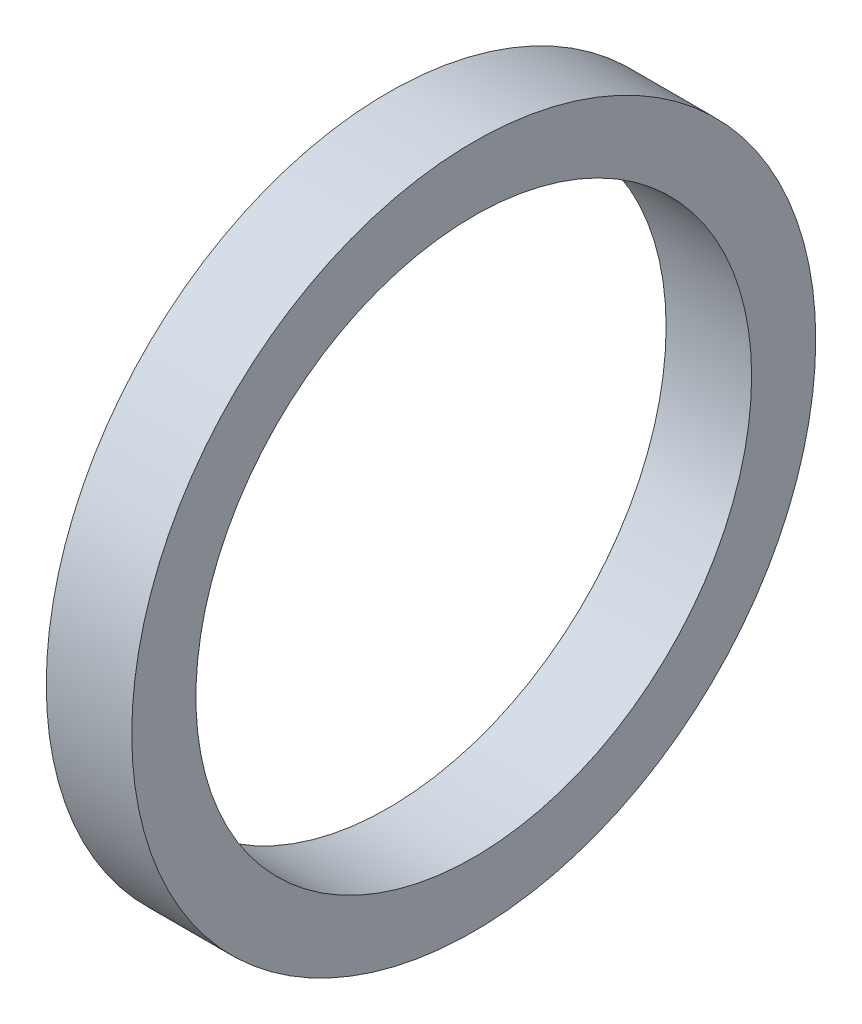
ISO-10303-21;
HEADER;
FILE_DESCRIPTION(('STEP AP214'),'2;1');
FILE_NAME('part.step','',(''),(''),'','','');
FILE_SCHEMA(('AUTOMOTIVE_DESIGN { 1 0 10303 214 1 1 1 1 }'));
ENDSEC;
DATA;
#1=APPLICATION_CONTEXT('core data for automotive mechanical design processes');
#2=APPLICATION_PROTOCOL_DEFINITION('international standard','automotive_design',2000,#1);
#3=PRODUCT_CONTEXT('',#1,'mechanical');
#4=PRODUCT('Part','Part','',(#3));
#5=PRODUCT_RELATED_PRODUCT_CATEGORY('part','',(#4));
#6=PRODUCT_DEFINITION_FORMATION('','',#4);
#7=PRODUCT_DEFINITION_CONTEXT('part definition',#1,'design');
#8=PRODUCT_DEFINITION('design','',#6,#7);
#9=PRODUCT_DEFINITION_SHAPE('','',#8);
#10=(LENGTH_UNIT() NAMED_UNIT(*) SI_UNIT(.MILLI.,.METRE.));
#11=(NAMED_UNIT(*) PLANE_ANGLE_UNIT() SI_UNIT($,.RADIAN.));
#12=(NAMED_UNIT(*) SI_UNIT($,.STERADIAN.) SOLID_ANGLE_UNIT());
#13=UNCERTAINTY_MEASURE_WITH_UNIT(LENGTH_MEASURE(1.E-05),#10,'distance_accuracy_value','');
#14=(GEOMETRIC_REPRESENTATION_CONTEXT(3) GLOBAL_UNCERTAINTY_ASSIGNED_CONTEXT((#13)) GLOBAL_UNIT_ASSIGNED_CONTEXT((#10,
#11,#12)) REPRESENTATION_CONTEXT('',''));
#15=CARTESIAN_POINT('',(0.,0.,0.));
#16=DIRECTION('',(0.,0.,1.));
#17=DIRECTION('',(1.,0.,0.));
#18=AXIS2_PLACEMENT_3D('',#15,#16,#17);
#19=CARTESIAN_POINT('',(10.,0.,0.));
#20=DIRECTION('',(1.,0.,0.));
#21=DIRECTION('',(0.,0.,-1.));
#22=AXIS2_PLACEMENT_3D('',#19,#20,#21);
#23=PLANE('',#22);
#24=CARTESIAN_POINT('',(10.,0.,0.));
#25=DIRECTION('',(1.,0.,0.));
#26=DIRECTION('',(0.,0.,-1.));
#27=AXIS2_PLACEMENT_3D('',#24,#25,#26);
#28=CIRCLE('',#27,40.);
#29=CARTESIAN_POINT('',(10.,0.,-40.));
#30=VERTEX_POINT('',#29);
#31=EDGE_CURVE('E10',#30,#30,#28,.T.);
#32=ORIENTED_EDGE('',*,*,#31,.T.);
#33=EDGE_LOOP('',(#32));
#34=FACE_BOUND('',#33,.T.);
#35=CARTESIAN_POINT('',(10.,0.,0.));
#36=DIRECTION('',(1.,0.,0.));
#37=DIRECTION('',(0.,0.,-1.));
#38=AXIS2_PLACEMENT_3D('',#35,#36,#37);
#39=CIRCLE('',#38,32.5);
#40=CARTESIAN_POINT('',(10.,0.,-32.5));
#41=VERTEX_POINT('',#40);
#42=EDGE_CURVE('E42',#41,#41,#39,.T.);
#43=ORIENTED_EDGE('',*,*,#42,.F.);
#44=EDGE_LOOP('',(#43));
#45=FACE_BOUND('',#44,.T.);
#46=ADVANCED_FACE('F31',(#34,#45),#23,.T.);
#47=CARTESIAN_POINT('',(0.,0.,0.));
#48=DIRECTION('',(1.,0.,0.));
#49=DIRECTION('',(0.,0.,-1.));
#50=AXIS2_PLACEMENT_3D('',#47,#48,#49);
#51=PLANE('',#50);
#52=CARTESIAN_POINT('',(0.,0.,0.));
#53=DIRECTION('',(1.,0.,0.));
#54=DIRECTION('',(0.,0.,-1.));
#55=AXIS2_PLACEMENT_3D('',#52,#53,#54);
#56=CIRCLE('',#55,40.);
#57=CARTESIAN_POINT('',(0.,0.,-40.));
#58=VERTEX_POINT('',#57);
#59=EDGE_CURVE('E35',#58,#58,#56,.T.);
#60=ORIENTED_EDGE('',*,*,#59,.F.);
#61=EDGE_LOOP('',(#60));
#62=FACE_BOUND('',#61,.T.);
#63=CARTESIAN_POINT('',(0.,0.,0.));
#64=DIRECTION('',(1.,0.,0.));
#65=DIRECTION('',(0.,0.,-1.));
#66=AXIS2_PLACEMENT_3D('',#63,#64,#65);
#67=CIRCLE('',#66,32.5);
#68=CARTESIAN_POINT('',(0.,0.,-32.5));
#69=VERTEX_POINT('',#68);
#70=EDGE_CURVE('E44',#69,#69,#67,.T.);
#71=ORIENTED_EDGE('',*,*,#70,.T.);
#72=EDGE_LOOP('',(#71));
#73=FACE_BOUND('',#72,.T.);
#74=ADVANCED_FACE('F54',(#62,#73),#51,.F.);
#75=CARTESIAN_POINT('',(10.,0.,0.));
#76=DIRECTION('',(-1.,0.,0.));
#77=DIRECTION('',(0.,0.,1.));
#78=AXIS2_PLACEMENT_3D('',#75,#76,#77);
#79=CYLINDRICAL_SURFACE('',#78,40.);
#80=ORIENTED_EDGE('',*,*,#31,.F.);
#81=EDGE_LOOP('',(#80));
#82=FACE_BOUND('',#81,.T.);
#83=ORIENTED_EDGE('',*,*,#59,.T.);
#84=EDGE_LOOP('',(#83));
#85=FACE_BOUND('',#84,.T.);
#86=ADVANCED_FACE('F33',(#82,#85),#79,.T.);
#87=CARTESIAN_POINT('',(10.,0.,0.));
#88=DIRECTION('',(-1.,0.,0.));
#89=DIRECTION('',(0.,0.,1.));
#90=AXIS2_PLACEMENT_3D('',#87,#88,#89);
#91=CYLINDRICAL_SURFACE('',#90,32.5);
#92=ORIENTED_EDGE('',*,*,#42,.T.);
#93=EDGE_LOOP('',(#92));
#94=FACE_BOUND('',#93,.T.);
#95=ORIENTED_EDGE('',*,*,#70,.F.);
#96=EDGE_LOOP('',(#95));
#97=FACE_BOUND('',#96,.T.);
#98=ADVANCED_FACE('F50',(#94,#97),#91,.F.);
#99=CLOSED_SHELL('',(#46,#74,#86,#98));
#100=MANIFOLD_SOLID_BREP('B2',#99);
#101=ADVANCED_BREP_SHAPE_REPRESENTATION('',(#18,#100),#14);
#102=SHAPE_DEFINITION_REPRESENTATION(#9,#101);
ENDSEC;
END-ISO-10303-21;
